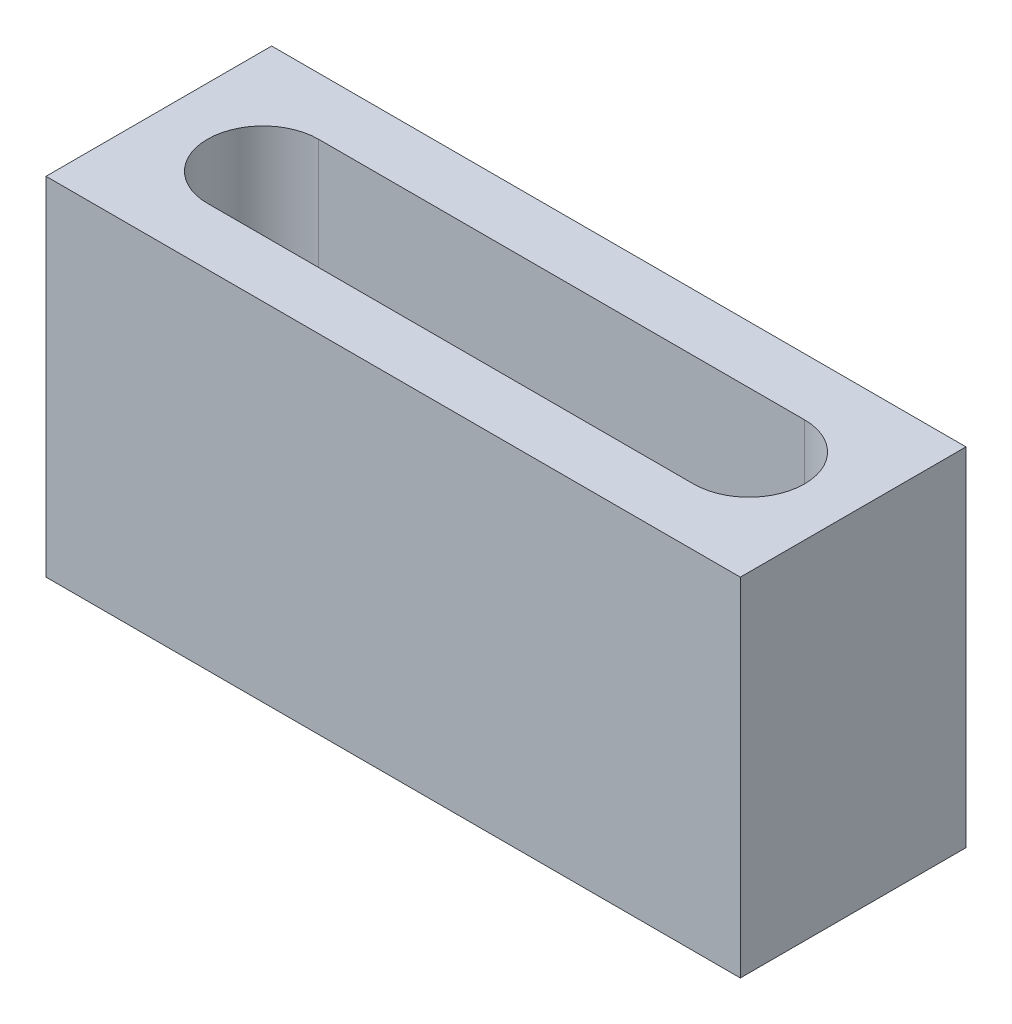
ISO-10303-21;
HEADER;
FILE_DESCRIPTION(('STEP AP214'),'2;1');
FILE_NAME('part.step','',(''),(''),'','','');
FILE_SCHEMA(('AUTOMOTIVE_DESIGN { 1 0 10303 214 1 1 1 1 }'));
ENDSEC;
DATA;
#1=APPLICATION_CONTEXT('core data for automotive mechanical design processes');
#2=APPLICATION_PROTOCOL_DEFINITION('international standard','automotive_design',2000,#1);
#3=PRODUCT_CONTEXT('',#1,'mechanical');
#4=PRODUCT('Part','Part','',(#3));
#5=PRODUCT_RELATED_PRODUCT_CATEGORY('part','',(#4));
#6=PRODUCT_DEFINITION_FORMATION('','',#4);
#7=PRODUCT_DEFINITION_CONTEXT('part definition',#1,'design');
#8=PRODUCT_DEFINITION('design','',#6,#7);
#9=PRODUCT_DEFINITION_SHAPE('','',#8);
#10=(LENGTH_UNIT() NAMED_UNIT(*) SI_UNIT(.MILLI.,.METRE.));
#11=(NAMED_UNIT(*) PLANE_ANGLE_UNIT() SI_UNIT($,.RADIAN.));
#12=(NAMED_UNIT(*) SI_UNIT($,.STERADIAN.) SOLID_ANGLE_UNIT());
#13=UNCERTAINTY_MEASURE_WITH_UNIT(LENGTH_MEASURE(1.E-05),#10,'distance_accuracy_value','');
#14=(GEOMETRIC_REPRESENTATION_CONTEXT(3) GLOBAL_UNCERTAINTY_ASSIGNED_CONTEXT((#13)) GLOBAL_UNIT_ASSIGNED_CONTEXT((#10,
#11,#12)) REPRESENTATION_CONTEXT('',''));
#15=CARTESIAN_POINT('',(0.,0.,0.));
#16=DIRECTION('',(0.,0.,1.));
#17=DIRECTION('',(1.,0.,0.));
#18=AXIS2_PLACEMENT_3D('',#15,#16,#17);
#19=CARTESIAN_POINT('',(0.,10.,0.));
#20=DIRECTION('',(0.,1.,0.));
#21=DIRECTION('',(0.,0.,1.));
#22=AXIS2_PLACEMENT_3D('',#19,#20,#21);
#23=PLANE('',#22);
#24=DIRECTION('',(0.,0.,-1.));
#25=VECTOR('',#24,1.);
#26=CARTESIAN_POINT('',(9.9999999999999,10.,-3.24999999999997));
#27=LINE('',#26,#25);
#28=CARTESIAN_POINT('',(9.9999999999999,10.,3.24999999999998));
#29=VERTEX_POINT('',#28);
#30=CARTESIAN_POINT('',(9.9999999999999,10.,-3.24999999999997));
#31=VERTEX_POINT('',#30);
#32=EDGE_CURVE('E153',#29,#31,#27,.T.);
#33=ORIENTED_EDGE('',*,*,#32,.T.);
#34=DIRECTION('',(-1.,0.,0.));
#35=VECTOR('',#34,1.);
#36=CARTESIAN_POINT('',(-10.0000000000001,10.,-3.25));
#37=LINE('',#36,#35);
#38=CARTESIAN_POINT('',(-10.0000000000001,10.,-3.25));
#39=VERTEX_POINT('',#38);
#40=EDGE_CURVE('E157',#31,#39,#37,.T.);
#41=ORIENTED_EDGE('',*,*,#40,.T.);
#42=DIRECTION('',(0.,0.,1.));
#43=VECTOR('',#42,1.);
#44=CARTESIAN_POINT('',(-10.0000000000001,10.,-3.25));
#45=LINE('',#44,#43);
#46=CARTESIAN_POINT('',(-10.0000000000001,10.,3.25));
#47=VERTEX_POINT('',#46);
#48=EDGE_CURVE('E161',#39,#47,#45,.T.);
#49=ORIENTED_EDGE('',*,*,#48,.T.);
#50=DIRECTION('',(1.,0.,0.));
#51=VECTOR('',#50,1.);
#52=CARTESIAN_POINT('',(-10.0000000000001,10.,3.25));
#53=LINE('',#52,#51);
#54=EDGE_CURVE('E164',#47,#29,#53,.T.);
#55=ORIENTED_EDGE('',*,*,#54,.T.);
#56=EDGE_LOOP('',(#33,#41,#49,#55));
#57=FACE_BOUND('',#56,.T.);
#58=DIRECTION('',(1.,0.,0.));
#59=VECTOR('',#58,1.);
#60=CARTESIAN_POINT('',(-7.00000000000009,10.,1.6));
#61=LINE('',#60,#59);
#62=CARTESIAN_POINT('',(-7.00000000000009,10.,1.6));
#63=VERTEX_POINT('',#62);
#64=CARTESIAN_POINT('',(6.9999999999999,10.,1.6));
#65=VERTEX_POINT('',#64);
#66=EDGE_CURVE('E114',#63,#65,#61,.T.);
#67=ORIENTED_EDGE('',*,*,#66,.F.);
#68=CARTESIAN_POINT('',(-7.00000000000009,10.,0.));
#69=DIRECTION('',(0.,1.,0.));
#70=DIRECTION('',(0.,0.,1.));
#71=AXIS2_PLACEMENT_3D('',#68,#69,#70);
#72=CIRCLE('',#71,1.6);
#73=CARTESIAN_POINT('',(-7.00000000000009,10.,-1.6));
#74=VERTEX_POINT('',#73);
#75=EDGE_CURVE('E105',#74,#63,#72,.T.);
#76=ORIENTED_EDGE('',*,*,#75,.F.);
#77=DIRECTION('',(-1.,0.,0.));
#78=VECTOR('',#77,1.);
#79=CARTESIAN_POINT('',(-7.00000000000009,10.,-1.6));
#80=LINE('',#79,#78);
#81=CARTESIAN_POINT('',(6.9999999999999,10.,-1.6));
#82=VERTEX_POINT('',#81);
#83=EDGE_CURVE('E131',#82,#74,#80,.T.);
#84=ORIENTED_EDGE('',*,*,#83,.F.);
#85=CARTESIAN_POINT('',(6.9999999999999,10.,0.));
#86=DIRECTION('',(0.,1.,0.));
#87=DIRECTION('',(0.,0.,1.));
#88=AXIS2_PLACEMENT_3D('',#85,#86,#87);
#89=CIRCLE('',#88,1.6);
#90=EDGE_CURVE('E127',#65,#82,#89,.T.);
#91=ORIENTED_EDGE('',*,*,#90,.F.);
#92=EDGE_LOOP('',(#67,#76,#84,#91));
#93=FACE_BOUND('',#92,.T.);
#94=ADVANCED_FACE('F39',(#57,#93),#23,.T.);
#95=CARTESIAN_POINT('',(0.,0.,0.));
#96=DIRECTION('',(0.,1.,0.));
#97=DIRECTION('',(0.,0.,1.));
#98=AXIS2_PLACEMENT_3D('',#95,#96,#97);
#99=PLANE('',#98);
#100=DIRECTION('',(0.,0.,-1.));
#101=VECTOR('',#100,1.);
#102=CARTESIAN_POINT('',(9.9999999999999,0.,-3.24999999999997));
#103=LINE('',#102,#101);
#104=CARTESIAN_POINT('',(9.9999999999999,0.,3.24999999999998));
#105=VERTEX_POINT('',#104);
#106=CARTESIAN_POINT('',(9.9999999999999,0.,-3.24999999999997));
#107=VERTEX_POINT('',#106);
#108=EDGE_CURVE('E123',#105,#107,#103,.T.);
#109=ORIENTED_EDGE('',*,*,#108,.F.);
#110=DIRECTION('',(1.,0.,0.));
#111=VECTOR('',#110,1.);
#112=CARTESIAN_POINT('',(-10.0000000000001,0.,3.25));
#113=LINE('',#112,#111);
#114=CARTESIAN_POINT('',(-10.0000000000001,0.,3.25));
#115=VERTEX_POINT('',#114);
#116=EDGE_CURVE('E158',#115,#105,#113,.T.);
#117=ORIENTED_EDGE('',*,*,#116,.F.);
#118=DIRECTION('',(0.,0.,1.));
#119=VECTOR('',#118,1.);
#120=CARTESIAN_POINT('',(-10.0000000000001,0.,-3.25));
#121=LINE('',#120,#119);
#122=CARTESIAN_POINT('',(-10.0000000000001,0.,-3.25));
#123=VERTEX_POINT('',#122);
#124=EDGE_CURVE('E174',#123,#115,#121,.T.);
#125=ORIENTED_EDGE('',*,*,#124,.F.);
#126=DIRECTION('',(-1.,0.,0.));
#127=VECTOR('',#126,1.);
#128=CARTESIAN_POINT('',(-10.0000000000001,0.,-3.25));
#129=LINE('',#128,#127);
#130=EDGE_CURVE('E171',#107,#123,#129,.T.);
#131=ORIENTED_EDGE('',*,*,#130,.F.);
#132=EDGE_LOOP('',(#109,#117,#125,#131));
#133=FACE_BOUND('',#132,.T.);
#134=CARTESIAN_POINT('',(-7.00000000000009,0.,0.));
#135=DIRECTION('',(0.,1.,0.));
#136=DIRECTION('',(0.,0.,1.));
#137=AXIS2_PLACEMENT_3D('',#134,#135,#136);
#138=CIRCLE('',#137,1.6);
#139=CARTESIAN_POINT('',(-7.00000000000009,0.,-1.6));
#140=VERTEX_POINT('',#139);
#141=CARTESIAN_POINT('',(-7.00000000000009,0.,1.6));
#142=VERTEX_POINT('',#141);
#143=EDGE_CURVE('E63',#140,#142,#138,.T.);
#144=ORIENTED_EDGE('',*,*,#143,.T.);
#145=DIRECTION('',(1.,0.,0.));
#146=VECTOR('',#145,1.);
#147=CARTESIAN_POINT('',(-7.00000000000009,0.,1.6));
#148=LINE('',#147,#146);
#149=CARTESIAN_POINT('',(6.9999999999999,0.,1.6));
#150=VERTEX_POINT('',#149);
#151=EDGE_CURVE('E121',#142,#150,#148,.T.);
#152=ORIENTED_EDGE('',*,*,#151,.T.);
#153=CARTESIAN_POINT('',(6.9999999999999,0.,0.));
#154=DIRECTION('',(0.,1.,0.));
#155=DIRECTION('',(0.,0.,1.));
#156=AXIS2_PLACEMENT_3D('',#153,#154,#155);
#157=CIRCLE('',#156,1.6);
#158=CARTESIAN_POINT('',(6.9999999999999,0.,-1.6));
#159=VERTEX_POINT('',#158);
#160=EDGE_CURVE('E140',#150,#159,#157,.T.);
#161=ORIENTED_EDGE('',*,*,#160,.T.);
#162=DIRECTION('',(-1.,0.,0.));
#163=VECTOR('',#162,1.);
#164=CARTESIAN_POINT('',(-7.00000000000009,0.,-1.6));
#165=LINE('',#164,#163);
#166=EDGE_CURVE('E115',#159,#140,#165,.T.);
#167=ORIENTED_EDGE('',*,*,#166,.T.);
#168=EDGE_LOOP('',(#144,#152,#161,#167));
#169=FACE_BOUND('',#168,.T.);
#170=ADVANCED_FACE('F197',(#133,#169),#99,.F.);
#171=CARTESIAN_POINT('',(9.9999999999999,10.,-3.24999999999997));
#172=DIRECTION('',(-1.,0.,0.));
#173=DIRECTION('',(0.,0.,1.));
#174=AXIS2_PLACEMENT_3D('',#171,#172,#173);
#175=PLANE('',#174);
#176=ORIENTED_EDGE('',*,*,#108,.T.);
#177=DIRECTION('',(0.,-1.,0.));
#178=VECTOR('',#177,1.);
#179=CARTESIAN_POINT('',(9.9999999999999,10.,-3.24999999999997));
#180=LINE('',#179,#178);
#181=EDGE_CURVE('E11',#31,#107,#180,.T.);
#182=ORIENTED_EDGE('',*,*,#181,.F.);
#183=ORIENTED_EDGE('',*,*,#32,.F.);
#184=DIRECTION('',(0.,-1.,0.));
#185=VECTOR('',#184,1.);
#186=CARTESIAN_POINT('',(9.9999999999999,10.,3.24999999999998));
#187=LINE('',#186,#185);
#188=EDGE_CURVE('E167',#29,#105,#187,.T.);
#189=ORIENTED_EDGE('',*,*,#188,.T.);
#190=EDGE_LOOP('',(#176,#182,#183,#189));
#191=FACE_BOUND('',#190,.T.);
#192=ADVANCED_FACE('F41',(#191),#175,.F.);
#193=CARTESIAN_POINT('',(-10.0000000000001,10.,-3.25));
#194=DIRECTION('',(0.,0.,1.));
#195=DIRECTION('',(1.,0.,0.));
#196=AXIS2_PLACEMENT_3D('',#193,#194,#195);
#197=PLANE('',#196);
#198=ORIENTED_EDGE('',*,*,#130,.T.);
#199=DIRECTION('',(0.,-1.,0.));
#200=VECTOR('',#199,1.);
#201=CARTESIAN_POINT('',(-10.0000000000001,10.,-3.25));
#202=LINE('',#201,#200);
#203=EDGE_CURVE('E48',#39,#123,#202,.T.);
#204=ORIENTED_EDGE('',*,*,#203,.F.);
#205=ORIENTED_EDGE('',*,*,#40,.F.);
#206=ORIENTED_EDGE('',*,*,#181,.T.);
#207=EDGE_LOOP('',(#198,#204,#205,#206));
#208=FACE_BOUND('',#207,.T.);
#209=ADVANCED_FACE('F207',(#208),#197,.F.);
#210=CARTESIAN_POINT('',(-10.0000000000001,10.,-3.25));
#211=DIRECTION('',(1.,0.,0.));
#212=DIRECTION('',(0.,0.,-1.));
#213=AXIS2_PLACEMENT_3D('',#210,#211,#212);
#214=PLANE('',#213);
#215=ORIENTED_EDGE('',*,*,#124,.T.);
#216=DIRECTION('',(0.,-1.,0.));
#217=VECTOR('',#216,1.);
#218=CARTESIAN_POINT('',(-10.0000000000001,10.,3.25));
#219=LINE('',#218,#217);
#220=EDGE_CURVE('E182',#47,#115,#219,.T.);
#221=ORIENTED_EDGE('',*,*,#220,.F.);
#222=ORIENTED_EDGE('',*,*,#48,.F.);
#223=ORIENTED_EDGE('',*,*,#203,.T.);
#224=EDGE_LOOP('',(#215,#221,#222,#223));
#225=FACE_BOUND('',#224,.T.);
#226=ADVANCED_FACE('F191',(#225),#214,.F.);
#227=CARTESIAN_POINT('',(-10.0000000000001,10.,3.25));
#228=DIRECTION('',(0.,0.,-1.));
#229=DIRECTION('',(-1.,0.,0.));
#230=AXIS2_PLACEMENT_3D('',#227,#228,#229);
#231=PLANE('',#230);
#232=ORIENTED_EDGE('',*,*,#116,.T.);
#233=ORIENTED_EDGE('',*,*,#188,.F.);
#234=ORIENTED_EDGE('',*,*,#54,.F.);
#235=ORIENTED_EDGE('',*,*,#220,.T.);
#236=EDGE_LOOP('',(#232,#233,#234,#235));
#237=FACE_BOUND('',#236,.T.);
#238=ADVANCED_FACE('F201',(#237),#231,.F.);
#239=CARTESIAN_POINT('',(-7.00000000000009,10.,0.));
#240=DIRECTION('',(0.,-1.,0.));
#241=DIRECTION('',(0.,0.,-1.));
#242=AXIS2_PLACEMENT_3D('',#239,#240,#241);
#243=CYLINDRICAL_SURFACE('',#242,1.6);
#244=ORIENTED_EDGE('',*,*,#143,.F.);
#245=DIRECTION('',(0.,-1.,0.));
#246=VECTOR('',#245,1.);
#247=CARTESIAN_POINT('',(-7.00000000000009,10.,-1.6));
#248=LINE('',#247,#246);
#249=EDGE_CURVE('E109',#74,#140,#248,.T.);
#250=ORIENTED_EDGE('',*,*,#249,.F.);
#251=ORIENTED_EDGE('',*,*,#75,.T.);
#252=DIRECTION('',(0.,-1.,0.));
#253=VECTOR('',#252,1.);
#254=CARTESIAN_POINT('',(-7.00000000000009,10.,1.6));
#255=LINE('',#254,#253);
#256=EDGE_CURVE('E108',#63,#142,#255,.T.);
#257=ORIENTED_EDGE('',*,*,#256,.T.);
#258=EDGE_LOOP('',(#244,#250,#251,#257));
#259=FACE_BOUND('',#258,.T.);
#260=ADVANCED_FACE('F107',(#259),#243,.F.);
#261=CARTESIAN_POINT('',(-7.00000000000009,10.,1.6));
#262=DIRECTION('',(0.,0.,-1.));
#263=DIRECTION('',(-1.,0.,0.));
#264=AXIS2_PLACEMENT_3D('',#261,#262,#263);
#265=PLANE('',#264);
#266=ORIENTED_EDGE('',*,*,#151,.F.);
#267=ORIENTED_EDGE('',*,*,#256,.F.);
#268=ORIENTED_EDGE('',*,*,#66,.T.);
#269=DIRECTION('',(0.,-1.,0.));
#270=VECTOR('',#269,1.);
#271=CARTESIAN_POINT('',(6.9999999999999,10.,1.6));
#272=LINE('',#271,#270);
#273=EDGE_CURVE('E124',#65,#150,#272,.T.);
#274=ORIENTED_EDGE('',*,*,#273,.T.);
#275=EDGE_LOOP('',(#266,#267,#268,#274));
#276=FACE_BOUND('',#275,.T.);
#277=ADVANCED_FACE('F118',(#276),#265,.T.);
#278=CARTESIAN_POINT('',(6.9999999999999,10.,0.));
#279=DIRECTION('',(0.,-1.,0.));
#280=DIRECTION('',(0.,0.,-1.));
#281=AXIS2_PLACEMENT_3D('',#278,#279,#280);
#282=CYLINDRICAL_SURFACE('',#281,1.6);
#283=ORIENTED_EDGE('',*,*,#160,.F.);
#284=ORIENTED_EDGE('',*,*,#273,.F.);
#285=ORIENTED_EDGE('',*,*,#90,.T.);
#286=DIRECTION('',(0.,-1.,0.));
#287=VECTOR('',#286,1.);
#288=CARTESIAN_POINT('',(6.9999999999999,10.,-1.6));
#289=LINE('',#288,#287);
#290=EDGE_CURVE('E55',#82,#159,#289,.T.);
#291=ORIENTED_EDGE('',*,*,#290,.T.);
#292=EDGE_LOOP('',(#283,#284,#285,#291));
#293=FACE_BOUND('',#292,.T.);
#294=ADVANCED_FACE('F230',(#293),#282,.F.);
#295=CARTESIAN_POINT('',(-7.00000000000009,10.,-1.6));
#296=DIRECTION('',(0.,0.,1.));
#297=DIRECTION('',(1.,0.,0.));
#298=AXIS2_PLACEMENT_3D('',#295,#296,#297);
#299=PLANE('',#298);
#300=ORIENTED_EDGE('',*,*,#166,.F.);
#301=ORIENTED_EDGE('',*,*,#290,.F.);
#302=ORIENTED_EDGE('',*,*,#83,.T.);
#303=ORIENTED_EDGE('',*,*,#249,.T.);
#304=EDGE_LOOP('',(#300,#301,#302,#303));
#305=FACE_BOUND('',#304,.T.);
#306=ADVANCED_FACE('F234',(#305),#299,.T.);
#307=CLOSED_SHELL('',(#94,#170,#192,#209,#226,#238,#260,#277,#294,#306));
#308=MANIFOLD_SOLID_BREP('B2',#307);
#309=ADVANCED_BREP_SHAPE_REPRESENTATION('',(#18,#308),#14);
#310=SHAPE_DEFINITION_REPRESENTATION(#9,#309);
ENDSEC;
END-ISO-10303-21;
